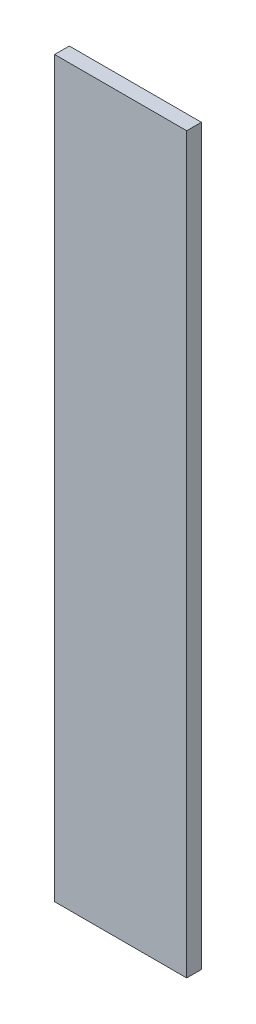
ISO-10303-21;
HEADER;
FILE_DESCRIPTION(('STEP AP214'),'2;1');
FILE_NAME('part.step','',(''),(''),'','','');
FILE_SCHEMA(('AUTOMOTIVE_DESIGN { 1 0 10303 214 1 1 1 1 }'));
ENDSEC;
DATA;
#1=APPLICATION_CONTEXT('core data for automotive mechanical design processes');
#2=APPLICATION_PROTOCOL_DEFINITION('international standard','automotive_design',2000,#1);
#3=PRODUCT_CONTEXT('',#1,'mechanical');
#4=PRODUCT('Part','Part','',(#3));
#5=PRODUCT_RELATED_PRODUCT_CATEGORY('part','',(#4));
#6=PRODUCT_DEFINITION_FORMATION('','',#4);
#7=PRODUCT_DEFINITION_CONTEXT('part definition',#1,'design');
#8=PRODUCT_DEFINITION('design','',#6,#7);
#9=PRODUCT_DEFINITION_SHAPE('','',#8);
#10=(LENGTH_UNIT() NAMED_UNIT(*) SI_UNIT(.MILLI.,.METRE.));
#11=(NAMED_UNIT(*) PLANE_ANGLE_UNIT() SI_UNIT($,.RADIAN.));
#12=(NAMED_UNIT(*) SI_UNIT($,.STERADIAN.) SOLID_ANGLE_UNIT());
#13=UNCERTAINTY_MEASURE_WITH_UNIT(LENGTH_MEASURE(1.E-05),#10,'distance_accuracy_value','');
#14=(GEOMETRIC_REPRESENTATION_CONTEXT(3) GLOBAL_UNCERTAINTY_ASSIGNED_CONTEXT((#13)) GLOBAL_UNIT_ASSIGNED_CONTEXT((#10,
#11,#12)) REPRESENTATION_CONTEXT('',''));
#15=CARTESIAN_POINT('',(0.,0.,0.));
#16=DIRECTION('',(0.,0.,1.));
#17=DIRECTION('',(1.,0.,0.));
#18=AXIS2_PLACEMENT_3D('',#15,#16,#17);
#19=CARTESIAN_POINT('',(0.,0.,5.));
#20=DIRECTION('',(1.,0.,0.));
#21=DIRECTION('',(0.,0.,-1.));
#22=AXIS2_PLACEMENT_3D('',#19,#20,#21);
#23=PLANE('',#22);
#24=DIRECTION('',(0.,-1.,0.));
#25=VECTOR('',#24,1.);
#26=CARTESIAN_POINT('',(0.,0.,0.));
#27=LINE('',#26,#25);
#28=CARTESIAN_POINT('',(0.,250.,0.));
#29=VERTEX_POINT('',#28);
#30=CARTESIAN_POINT('',(0.,0.,0.));
#31=VERTEX_POINT('',#30);
#32=EDGE_CURVE('E96',#29,#31,#27,.T.);
#33=ORIENTED_EDGE('',*,*,#32,.T.);
#34=DIRECTION('',(0.,0.,-1.));
#35=VECTOR('',#34,1.);
#36=CARTESIAN_POINT('',(0.,0.,5.));
#37=LINE('',#36,#35);
#38=CARTESIAN_POINT('',(0.,0.,5.));
#39=VERTEX_POINT('',#38);
#40=EDGE_CURVE('E11',#39,#31,#37,.T.);
#41=ORIENTED_EDGE('',*,*,#40,.F.);
#42=DIRECTION('',(0.,-1.,0.));
#43=VECTOR('',#42,1.);
#44=CARTESIAN_POINT('',(0.,0.,5.));
#45=LINE('',#44,#43);
#46=CARTESIAN_POINT('',(0.,250.,5.));
#47=VERTEX_POINT('',#46);
#48=EDGE_CURVE('E84',#47,#39,#45,.T.);
#49=ORIENTED_EDGE('',*,*,#48,.F.);
#50=DIRECTION('',(0.,0.,-1.));
#51=VECTOR('',#50,1.);
#52=CARTESIAN_POINT('',(0.,250.,5.));
#53=LINE('',#52,#51);
#54=EDGE_CURVE('E92',#47,#29,#53,.T.);
#55=ORIENTED_EDGE('',*,*,#54,.T.);
#56=EDGE_LOOP('',(#33,#41,#49,#55));
#57=FACE_BOUND('',#56,.T.);
#58=ADVANCED_FACE('F33',(#57),#23,.F.);
#59=CARTESIAN_POINT('',(0.,0.,5.));
#60=DIRECTION('',(0.,1.,0.));
#61=DIRECTION('',(0.,0.,1.));
#62=AXIS2_PLACEMENT_3D('',#59,#60,#61);
#63=PLANE('',#62);
#64=DIRECTION('',(1.,0.,0.));
#65=VECTOR('',#64,1.);
#66=CARTESIAN_POINT('',(0.,0.,0.));
#67=LINE('',#66,#65);
#68=CARTESIAN_POINT('',(45.,0.,0.));
#69=VERTEX_POINT('',#68);
#70=EDGE_CURVE('E88',#31,#69,#67,.T.);
#71=ORIENTED_EDGE('',*,*,#70,.T.);
#72=DIRECTION('',(0.,0.,-1.));
#73=VECTOR('',#72,1.);
#74=CARTESIAN_POINT('',(45.,0.,5.));
#75=LINE('',#74,#73);
#76=CARTESIAN_POINT('',(45.,0.,5.));
#77=VERTEX_POINT('',#76);
#78=EDGE_CURVE('E41',#77,#69,#75,.T.);
#79=ORIENTED_EDGE('',*,*,#78,.F.);
#80=DIRECTION('',(1.,0.,0.));
#81=VECTOR('',#80,1.);
#82=CARTESIAN_POINT('',(0.,0.,5.));
#83=LINE('',#82,#81);
#84=EDGE_CURVE('E79',#39,#77,#83,.T.);
#85=ORIENTED_EDGE('',*,*,#84,.F.);
#86=ORIENTED_EDGE('',*,*,#40,.T.);
#87=EDGE_LOOP('',(#71,#79,#85,#86));
#88=FACE_BOUND('',#87,.T.);
#89=ADVANCED_FACE('F87',(#88),#63,.F.);
#90=CARTESIAN_POINT('',(45.,0.,5.));
#91=DIRECTION('',(-1.,0.,0.));
#92=DIRECTION('',(0.,0.,1.));
#93=AXIS2_PLACEMENT_3D('',#90,#91,#92);
#94=PLANE('',#93);
#95=DIRECTION('',(0.,1.,0.));
#96=VECTOR('',#95,1.);
#97=CARTESIAN_POINT('',(45.,0.,0.));
#98=LINE('',#97,#96);
#99=CARTESIAN_POINT('',(45.,250.,0.));
#100=VERTEX_POINT('',#99);
#101=EDGE_CURVE('E66',#69,#100,#98,.T.);
#102=ORIENTED_EDGE('',*,*,#101,.T.);
#103=DIRECTION('',(0.,0.,-1.));
#104=VECTOR('',#103,1.);
#105=CARTESIAN_POINT('',(45.,250.,5.));
#106=LINE('',#105,#104);
#107=CARTESIAN_POINT('',(45.,250.,5.));
#108=VERTEX_POINT('',#107);
#109=EDGE_CURVE('E89',#108,#100,#106,.T.);
#110=ORIENTED_EDGE('',*,*,#109,.F.);
#111=DIRECTION('',(0.,1.,0.));
#112=VECTOR('',#111,1.);
#113=CARTESIAN_POINT('',(45.,0.,5.));
#114=LINE('',#113,#112);
#115=EDGE_CURVE('E82',#77,#108,#114,.T.);
#116=ORIENTED_EDGE('',*,*,#115,.F.);
#117=ORIENTED_EDGE('',*,*,#78,.T.);
#118=EDGE_LOOP('',(#102,#110,#116,#117));
#119=FACE_BOUND('',#118,.T.);
#120=ADVANCED_FACE('F90',(#119),#94,.F.);
#121=CARTESIAN_POINT('',(0.,250.,5.));
#122=DIRECTION('',(0.,-1.,0.));
#123=DIRECTION('',(0.,0.,-1.));
#124=AXIS2_PLACEMENT_3D('',#121,#122,#123);
#125=PLANE('',#124);
#126=DIRECTION('',(-1.,0.,0.));
#127=VECTOR('',#126,1.);
#128=CARTESIAN_POINT('',(0.,250.,0.));
#129=LINE('',#128,#127);
#130=EDGE_CURVE('E72',#100,#29,#129,.T.);
#131=ORIENTED_EDGE('',*,*,#130,.T.);
#132=ORIENTED_EDGE('',*,*,#54,.F.);
#133=DIRECTION('',(-1.,0.,0.));
#134=VECTOR('',#133,1.);
#135=CARTESIAN_POINT('',(0.,250.,5.));
#136=LINE('',#135,#134);
#137=EDGE_CURVE('E49',#108,#47,#136,.T.);
#138=ORIENTED_EDGE('',*,*,#137,.F.);
#139=ORIENTED_EDGE('',*,*,#109,.T.);
#140=EDGE_LOOP('',(#131,#132,#138,#139));
#141=FACE_BOUND('',#140,.T.);
#142=ADVANCED_FACE('F103',(#141),#125,.F.);
#143=CARTESIAN_POINT('',(0.,0.,5.));
#144=DIRECTION('',(0.,0.,-1.));
#145=DIRECTION('',(-1.,0.,0.));
#146=AXIS2_PLACEMENT_3D('',#143,#144,#145);
#147=PLANE('',#146);
#148=ORIENTED_EDGE('',*,*,#48,.T.);
#149=ORIENTED_EDGE('',*,*,#84,.T.);
#150=ORIENTED_EDGE('',*,*,#115,.T.);
#151=ORIENTED_EDGE('',*,*,#137,.T.);
#152=EDGE_LOOP('',(#148,#149,#150,#151));
#153=FACE_BOUND('',#152,.T.);
#154=ADVANCED_FACE('F80',(#153),#147,.F.);
#155=CARTESIAN_POINT('',(0.,0.,0.));
#156=DIRECTION('',(0.,0.,-1.));
#157=DIRECTION('',(-1.,0.,0.));
#158=AXIS2_PLACEMENT_3D('',#155,#156,#157);
#159=PLANE('',#158);
#160=ORIENTED_EDGE('',*,*,#32,.F.);
#161=ORIENTED_EDGE('',*,*,#130,.F.);
#162=ORIENTED_EDGE('',*,*,#101,.F.);
#163=ORIENTED_EDGE('',*,*,#70,.F.);
#164=EDGE_LOOP('',(#160,#161,#162,#163));
#165=FACE_BOUND('',#164,.T.);
#166=ADVANCED_FACE('F106',(#165),#159,.T.);
#167=CLOSED_SHELL('',(#58,#89,#120,#142,#154,#166));
#168=MANIFOLD_SOLID_BREP('B2',#167);
#169=ADVANCED_BREP_SHAPE_REPRESENTATION('',(#18,#168),#14);
#170=SHAPE_DEFINITION_REPRESENTATION(#9,#169);
ENDSEC;
END-ISO-10303-21;
